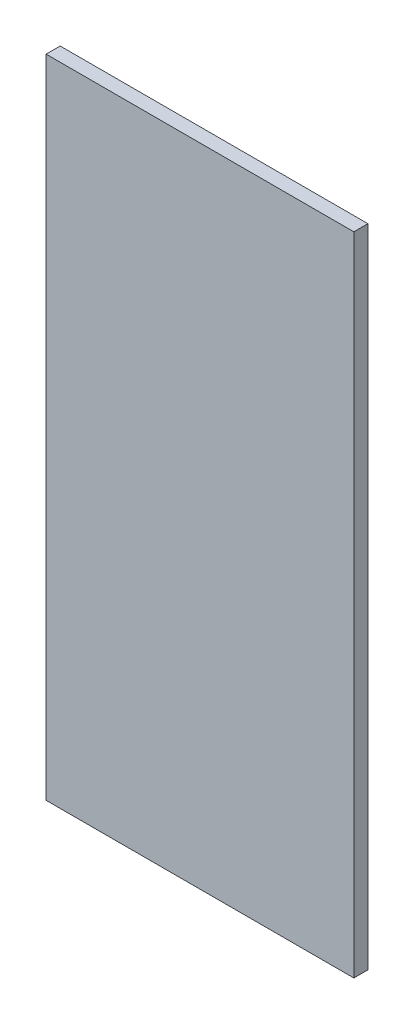
ISO-10303-21;
HEADER;
FILE_DESCRIPTION(('STEP AP214'),'2;1');
FILE_NAME('part.step','',(''),(''),'','','');
FILE_SCHEMA(('AUTOMOTIVE_DESIGN { 1 0 10303 214 1 1 1 1 }'));
ENDSEC;
DATA;
#1=APPLICATION_CONTEXT('core data for automotive mechanical design processes');
#2=APPLICATION_PROTOCOL_DEFINITION('international standard','automotive_design',2000,#1);
#3=PRODUCT_CONTEXT('',#1,'mechanical');
#4=PRODUCT('Part','Part','',(#3));
#5=PRODUCT_RELATED_PRODUCT_CATEGORY('part','',(#4));
#6=PRODUCT_DEFINITION_FORMATION('','',#4);
#7=PRODUCT_DEFINITION_CONTEXT('part definition',#1,'design');
#8=PRODUCT_DEFINITION('design','',#6,#7);
#9=PRODUCT_DEFINITION_SHAPE('','',#8);
#10=(LENGTH_UNIT() NAMED_UNIT(*) SI_UNIT(.MILLI.,.METRE.));
#11=(NAMED_UNIT(*) PLANE_ANGLE_UNIT() SI_UNIT($,.RADIAN.));
#12=(NAMED_UNIT(*) SI_UNIT($,.STERADIAN.) SOLID_ANGLE_UNIT());
#13=UNCERTAINTY_MEASURE_WITH_UNIT(LENGTH_MEASURE(1.E-05),#10,'distance_accuracy_value','');
#14=(GEOMETRIC_REPRESENTATION_CONTEXT(3) GLOBAL_UNCERTAINTY_ASSIGNED_CONTEXT((#13)) GLOBAL_UNIT_ASSIGNED_CONTEXT((#10,
#11,#12)) REPRESENTATION_CONTEXT('',''));
#15=CARTESIAN_POINT('',(0.,0.,0.));
#16=DIRECTION('',(0.,0.,1.));
#17=DIRECTION('',(1.,0.,0.));
#18=AXIS2_PLACEMENT_3D('',#15,#16,#17);
#19=CARTESIAN_POINT('',(0.,0.,-1.6));
#20=DIRECTION('',(0.,0.,1.));
#21=DIRECTION('',(1.,0.,0.));
#22=AXIS2_PLACEMENT_3D('',#19,#20,#21);
#23=PLANE('',#22);
#24=DIRECTION('',(-1.,0.,0.));
#25=VECTOR('',#24,1.);
#26=CARTESIAN_POINT('',(35.0298958892,-73.44667800658,-1.6));
#27=LINE('',#26,#25);
#28=CARTESIAN_POINT('',(35.0298958892,-73.44667800658,-1.6));
#29=VERTEX_POINT('',#28);
#30=CARTESIAN_POINT('',(0.02989730919929,-73.44667800658,-1.6));
#31=VERTEX_POINT('',#30);
#32=EDGE_CURVE('E77',#29,#31,#27,.T.);
#33=ORIENTED_EDGE('',*,*,#32,.T.);
#34=DIRECTION('',(0.,1.,0.));
#35=VECTOR('',#34,1.);
#36=CARTESIAN_POINT('',(0.02989730919929,-73.44667800658,-1.6));
#37=LINE('',#36,#35);
#38=CARTESIAN_POINT('',(0.029897309199292,0.05332231342169,-1.6));
#39=VERTEX_POINT('',#38);
#40=EDGE_CURVE('E11',#31,#39,#37,.T.);
#41=ORIENTED_EDGE('',*,*,#40,.T.);
#42=DIRECTION('',(1.,0.,0.));
#43=VECTOR('',#42,1.);
#44=CARTESIAN_POINT('',(0.029897309199292,0.05332231342169,-1.6));
#45=LINE('',#44,#43);
#46=CARTESIAN_POINT('',(35.0298958892,0.0533223134216883,-1.6));
#47=VERTEX_POINT('',#46);
#48=EDGE_CURVE('E43',#39,#47,#45,.T.);
#49=ORIENTED_EDGE('',*,*,#48,.T.);
#50=DIRECTION('',(0.,-1.,0.));
#51=VECTOR('',#50,1.);
#52=CARTESIAN_POINT('',(35.0298958892,0.0533223134216883,-1.6));
#53=LINE('',#52,#51);
#54=EDGE_CURVE('E81',#47,#29,#53,.T.);
#55=ORIENTED_EDGE('',*,*,#54,.T.);
#56=EDGE_LOOP('',(#33,#41,#49,#55));
#57=FACE_BOUND('',#56,.T.);
#58=ADVANCED_FACE('F17',(#57),#23,.F.);
#59=CARTESIAN_POINT('',(0.02989730919929,0.05332231342169,0.));
#60=DIRECTION('',(-1.,0.,0.));
#61=DIRECTION('',(0.,0.,1.));
#62=AXIS2_PLACEMENT_3D('',#59,#60,#61);
#63=PLANE('',#62);
#64=DIRECTION('',(0.,1.,0.));
#65=VECTOR('',#64,1.);
#66=CARTESIAN_POINT('',(0.02989730919929,-73.44667800658,0.));
#67=LINE('',#66,#65);
#68=CARTESIAN_POINT('',(0.02989730919929,-73.44667800658,0.));
#69=VERTEX_POINT('',#68);
#70=CARTESIAN_POINT('',(0.029897309199291,0.05332231342169,0.));
#71=VERTEX_POINT('',#70);
#72=EDGE_CURVE('E96',#69,#71,#67,.T.);
#73=ORIENTED_EDGE('',*,*,#72,.T.);
#74=DIRECTION('',(0.,0.,1.));
#75=VECTOR('',#74,1.);
#76=CARTESIAN_POINT('',(0.02989730919929,0.05332231342169,-1.6));
#77=LINE('',#76,#75);
#78=EDGE_CURVE('E26',#39,#71,#77,.T.);
#79=ORIENTED_EDGE('',*,*,#78,.F.);
#80=ORIENTED_EDGE('',*,*,#40,.F.);
#81=DIRECTION('',(0.,0.,1.));
#82=VECTOR('',#81,1.);
#83=CARTESIAN_POINT('',(0.02989730919929,-73.44667800658,-1.6));
#84=LINE('',#83,#82);
#85=EDGE_CURVE('E107',#31,#69,#84,.T.);
#86=ORIENTED_EDGE('',*,*,#85,.T.);
#87=EDGE_LOOP('',(#73,#79,#80,#86));
#88=FACE_BOUND('',#87,.T.);
#89=ADVANCED_FACE('F189',(#88),#63,.T.);
#90=CARTESIAN_POINT('',(35.0298958892,0.05332231342169,0.));
#91=DIRECTION('',(0.,1.,0.));
#92=DIRECTION('',(1.,0.,0.));
#93=AXIS2_PLACEMENT_3D('',#90,#91,#92);
#94=PLANE('',#93);
#95=DIRECTION('',(1.,0.,0.));
#96=VECTOR('',#95,1.);
#97=CARTESIAN_POINT('',(0.02989730919929,0.05332231342169,0.));
#98=LINE('',#97,#96);
#99=CARTESIAN_POINT('',(35.0298958892,0.0533223134216891,0.));
#100=VERTEX_POINT('',#99);
#101=EDGE_CURVE('E91',#71,#100,#98,.T.);
#102=ORIENTED_EDGE('',*,*,#101,.T.);
#103=DIRECTION('',(0.,0.,1.));
#104=VECTOR('',#103,1.);
#105=CARTESIAN_POINT('',(35.0298958892,0.05332231342169,-1.6));
#106=LINE('',#105,#104);
#107=EDGE_CURVE('E86',#47,#100,#106,.T.);
#108=ORIENTED_EDGE('',*,*,#107,.F.);
#109=ORIENTED_EDGE('',*,*,#48,.F.);
#110=ORIENTED_EDGE('',*,*,#78,.T.);
#111=EDGE_LOOP('',(#102,#108,#109,#110));
#112=FACE_BOUND('',#111,.T.);
#113=ADVANCED_FACE('F19',(#112),#94,.T.);
#114=CARTESIAN_POINT('',(35.0298958892,-73.44667800658,0.));
#115=DIRECTION('',(1.,0.,0.));
#116=DIRECTION('',(0.,1.,0.));
#117=AXIS2_PLACEMENT_3D('',#114,#115,#116);
#118=PLANE('',#117);
#119=DIRECTION('',(0.,-1.,0.));
#120=VECTOR('',#119,1.);
#121=CARTESIAN_POINT('',(35.0298958892,0.05332231342169,0.));
#122=LINE('',#121,#120);
#123=CARTESIAN_POINT('',(35.0298958892,-73.44667800658,0.));
#124=VERTEX_POINT('',#123);
#125=EDGE_CURVE('E84',#100,#124,#122,.T.);
#126=ORIENTED_EDGE('',*,*,#125,.T.);
#127=DIRECTION('',(0.,0.,1.));
#128=VECTOR('',#127,1.);
#129=CARTESIAN_POINT('',(35.0298958892,-73.44667800658,-1.6));
#130=LINE('',#129,#128);
#131=EDGE_CURVE('E71',#29,#124,#130,.T.);
#132=ORIENTED_EDGE('',*,*,#131,.F.);
#133=ORIENTED_EDGE('',*,*,#54,.F.);
#134=ORIENTED_EDGE('',*,*,#107,.T.);
#135=EDGE_LOOP('',(#126,#132,#133,#134));
#136=FACE_BOUND('',#135,.T.);
#137=ADVANCED_FACE('F85',(#136),#118,.T.);
#138=CARTESIAN_POINT('',(0.02989730919929,-73.44667800658,0.));
#139=DIRECTION('',(0.,-1.,0.));
#140=DIRECTION('',(0.,0.,-1.));
#141=AXIS2_PLACEMENT_3D('',#138,#139,#140);
#142=PLANE('',#141);
#143=DIRECTION('',(-1.,0.,0.));
#144=VECTOR('',#143,1.);
#145=CARTESIAN_POINT('',(35.0298958892,-73.44667800658,0.));
#146=LINE('',#145,#144);
#147=EDGE_CURVE('E76',#124,#69,#146,.T.);
#148=ORIENTED_EDGE('',*,*,#147,.T.);
#149=ORIENTED_EDGE('',*,*,#85,.F.);
#150=ORIENTED_EDGE('',*,*,#32,.F.);
#151=ORIENTED_EDGE('',*,*,#131,.T.);
#152=EDGE_LOOP('',(#148,#149,#150,#151));
#153=FACE_BOUND('',#152,.T.);
#154=ADVANCED_FACE('F73',(#153),#142,.T.);
#155=CARTESIAN_POINT('',(0.,0.,0.));
#156=DIRECTION('',(0.,0.,1.));
#157=DIRECTION('',(1.,0.,0.));
#158=AXIS2_PLACEMENT_3D('',#155,#156,#157);
#159=PLANE('',#158);
#160=ORIENTED_EDGE('',*,*,#147,.F.);
#161=ORIENTED_EDGE('',*,*,#125,.F.);
#162=ORIENTED_EDGE('',*,*,#101,.F.);
#163=ORIENTED_EDGE('',*,*,#72,.F.);
#164=EDGE_LOOP('',(#160,#161,#162,#163));
#165=FACE_BOUND('',#164,.T.);
#166=ADVANCED_FACE('F94',(#165),#159,.T.);
#167=CLOSED_SHELL('',(#58,#89,#113,#137,#154,#166));
#168=MANIFOLD_SOLID_BREP('B1',#167);
#169=ADVANCED_BREP_SHAPE_REPRESENTATION('',(#18,#168),#14);
#170=SHAPE_DEFINITION_REPRESENTATION(#9,#169);
ENDSEC;
END-ISO-10303-21;
